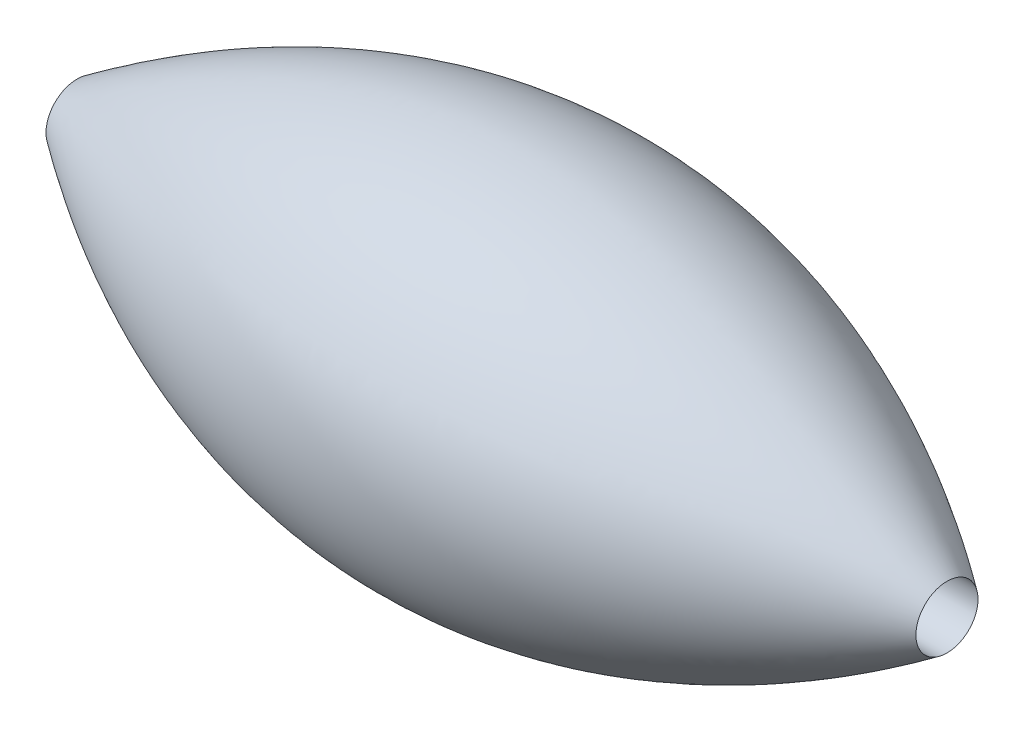
ISO-10303-21;
HEADER;
FILE_DESCRIPTION(('STEP AP214'),'2;1');
FILE_NAME('part.step','',(''),(''),'','','');
FILE_SCHEMA(('AUTOMOTIVE_DESIGN { 1 0 10303 214 1 1 1 1 }'));
ENDSEC;
DATA;
#1=APPLICATION_CONTEXT('core data for automotive mechanical design processes');
#2=APPLICATION_PROTOCOL_DEFINITION('international standard','automotive_design',2000,#1);
#3=PRODUCT_CONTEXT('',#1,'mechanical');
#4=PRODUCT('Part','Part','',(#3));
#5=PRODUCT_RELATED_PRODUCT_CATEGORY('part','',(#4));
#6=PRODUCT_DEFINITION_FORMATION('','',#4);
#7=PRODUCT_DEFINITION_CONTEXT('part definition',#1,'design');
#8=PRODUCT_DEFINITION('design','',#6,#7);
#9=PRODUCT_DEFINITION_SHAPE('','',#8);
#10=(LENGTH_UNIT() NAMED_UNIT(*) SI_UNIT(.MILLI.,.METRE.));
#11=(NAMED_UNIT(*) PLANE_ANGLE_UNIT() SI_UNIT($,.RADIAN.));
#12=(NAMED_UNIT(*) SI_UNIT($,.STERADIAN.) SOLID_ANGLE_UNIT());
#13=UNCERTAINTY_MEASURE_WITH_UNIT(LENGTH_MEASURE(1.E-05),#10,'distance_accuracy_value','');
#14=(GEOMETRIC_REPRESENTATION_CONTEXT(3) GLOBAL_UNCERTAINTY_ASSIGNED_CONTEXT((#13)) GLOBAL_UNIT_ASSIGNED_CONTEXT((#10,
#11,#12)) REPRESENTATION_CONTEXT('',''));
#15=CARTESIAN_POINT('',(0.,0.,0.));
#16=DIRECTION('',(0.,0.,1.));
#17=DIRECTION('',(1.,0.,0.));
#18=AXIS2_PLACEMENT_3D('',#15,#16,#17);
#19=CARTESIAN_POINT('',(0.,0.,0.));
#20=CARTESIAN_POINT('',(14.,10.,0.));
#21=CARTESIAN_POINT('',(28.,0.,0.));
#22=B_SPLINE_CURVE_WITH_KNOTS('',2,(#19,#20,#21),.UNSPECIFIED.,.F.,.F.,(3,3),(0.,1.),.UNSPECIFIED.);
#23=CARTESIAN_POINT('',(0.,-1.,0.));
#24=DIRECTION('',(-1.,0.,0.));
#25=AXIS1_PLACEMENT('',#23,#24);
#26=SURFACE_OF_REVOLUTION('',#22,#25);
#27=CARTESIAN_POINT('',(28.,-1.,0.));
#28=DIRECTION('',(-1.,0.,0.));
#29=DIRECTION('',(0.,0.,1.));
#30=AXIS2_PLACEMENT_3D('',#27,#28,#29);
#31=CIRCLE('',#30,1.);
#32=CARTESIAN_POINT('',(28.,-1.,1.));
#33=VERTEX_POINT('',#32);
#34=EDGE_CURVE('E41',#33,#33,#31,.T.);
#35=ORIENTED_EDGE('',*,*,#34,.T.);
#36=EDGE_LOOP('',(#35));
#37=FACE_BOUND('',#36,.T.);
#38=CARTESIAN_POINT('',(0.,-1.,0.));
#39=DIRECTION('',(-1.,0.,0.));
#40=DIRECTION('',(0.,0.,1.));
#41=AXIS2_PLACEMENT_3D('',#38,#39,#40);
#42=CIRCLE('',#41,1.);
#43=CARTESIAN_POINT('',(0.,-1.,1.));
#44=VERTEX_POINT('',#43);
#45=EDGE_CURVE('E10',#44,#44,#42,.T.);
#46=ORIENTED_EDGE('',*,*,#45,.F.);
#47=EDGE_LOOP('',(#46));
#48=FACE_BOUND('',#47,.T.);
#49=ADVANCED_FACE('F34',(#37,#48),#26,.F.);
#50=CARTESIAN_POINT('',(0.,-1.,0.));
#51=DIRECTION('',(-1.,0.,0.));
#52=DIRECTION('',(0.,0.,1.));
#53=AXIS2_PLACEMENT_3D('',#50,#51,#52);
#54=CYLINDRICAL_SURFACE('',#53,1.);
#55=ORIENTED_EDGE('',*,*,#34,.F.);
#56=EDGE_LOOP('',(#55));
#57=FACE_BOUND('',#56,.T.);
#58=ORIENTED_EDGE('',*,*,#45,.T.);
#59=EDGE_LOOP('',(#58));
#60=FACE_BOUND('',#59,.T.);
#61=ADVANCED_FACE('F55',(#57,#60),#54,.F.);
#62=CLOSED_SHELL('',(#49,#61));
#63=MANIFOLD_SOLID_BREP('B2',#62);
#64=ADVANCED_BREP_SHAPE_REPRESENTATION('',(#18,#63),#14);
#65=SHAPE_DEFINITION_REPRESENTATION(#9,#64);
ENDSEC;
END-ISO-10303-21;
